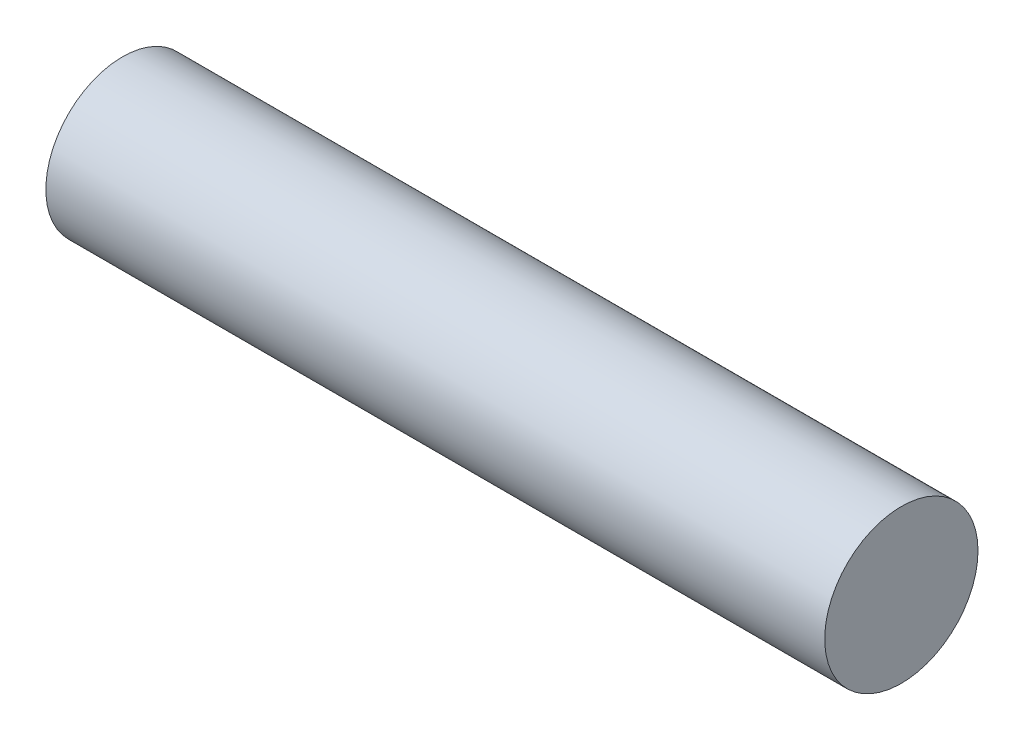
ISO-10303-21;
HEADER;
FILE_DESCRIPTION(('STEP AP214'),'2;1');
FILE_NAME('part.step','',(''),(''),'','','');
FILE_SCHEMA(('AUTOMOTIVE_DESIGN { 1 0 10303 214 1 1 1 1 }'));
ENDSEC;
DATA;
#1=APPLICATION_CONTEXT('core data for automotive mechanical design processes');
#2=APPLICATION_PROTOCOL_DEFINITION('international standard','automotive_design',2000,#1);
#3=PRODUCT_CONTEXT('',#1,'mechanical');
#4=PRODUCT('Part','Part','',(#3));
#5=PRODUCT_RELATED_PRODUCT_CATEGORY('part','',(#4));
#6=PRODUCT_DEFINITION_FORMATION('','',#4);
#7=PRODUCT_DEFINITION_CONTEXT('part definition',#1,'design');
#8=PRODUCT_DEFINITION('design','',#6,#7);
#9=PRODUCT_DEFINITION_SHAPE('','',#8);
#10=(LENGTH_UNIT() NAMED_UNIT(*) SI_UNIT(.MILLI.,.METRE.));
#11=(NAMED_UNIT(*) PLANE_ANGLE_UNIT() SI_UNIT($,.RADIAN.));
#12=(NAMED_UNIT(*) SI_UNIT($,.STERADIAN.) SOLID_ANGLE_UNIT());
#13=UNCERTAINTY_MEASURE_WITH_UNIT(LENGTH_MEASURE(1.E-05),#10,'distance_accuracy_value','');
#14=(GEOMETRIC_REPRESENTATION_CONTEXT(3) GLOBAL_UNCERTAINTY_ASSIGNED_CONTEXT((#13)) GLOBAL_UNIT_ASSIGNED_CONTEXT((#10,
#11,#12)) REPRESENTATION_CONTEXT('',''));
#15=CARTESIAN_POINT('',(0.,0.,0.));
#16=DIRECTION('',(0.,0.,1.));
#17=DIRECTION('',(1.,0.,0.));
#18=AXIS2_PLACEMENT_3D('',#15,#16,#17);
#19=CARTESIAN_POINT('',(25.4,0.,0.));
#20=DIRECTION('',(-1.,0.,0.));
#21=DIRECTION('',(0.,0.,1.));
#22=AXIS2_PLACEMENT_3D('',#19,#20,#21);
#23=CYLINDRICAL_SURFACE('',#22,5.);
#24=CARTESIAN_POINT('',(25.4,0.,0.));
#25=DIRECTION('',(1.,0.,0.));
#26=DIRECTION('',(0.,0.,-1.));
#27=AXIS2_PLACEMENT_3D('',#24,#25,#26);
#28=CIRCLE('',#27,5.);
#29=CARTESIAN_POINT('',(25.4,0.,-5.));
#30=VERTEX_POINT('',#29);
#31=EDGE_CURVE('E10',#30,#30,#28,.T.);
#32=ORIENTED_EDGE('',*,*,#31,.F.);
#33=EDGE_LOOP('',(#32));
#34=FACE_BOUND('',#33,.T.);
#35=CARTESIAN_POINT('',(-25.4,0.,0.));
#36=DIRECTION('',(1.,0.,0.));
#37=DIRECTION('',(0.,0.,-1.));
#38=AXIS2_PLACEMENT_3D('',#35,#36,#37);
#39=CIRCLE('',#38,5.);
#40=CARTESIAN_POINT('',(-25.4,0.,-5.));
#41=VERTEX_POINT('',#40);
#42=EDGE_CURVE('E40',#41,#41,#39,.T.);
#43=ORIENTED_EDGE('',*,*,#42,.T.);
#44=EDGE_LOOP('',(#43));
#45=FACE_BOUND('',#44,.T.);
#46=ADVANCED_FACE('F37',(#34,#45),#23,.T.);
#47=CARTESIAN_POINT('',(25.4,0.,0.));
#48=DIRECTION('',(1.,0.,0.));
#49=DIRECTION('',(0.,0.,-1.));
#50=AXIS2_PLACEMENT_3D('',#47,#48,#49);
#51=PLANE('',#50);
#52=ORIENTED_EDGE('',*,*,#31,.T.);
#53=EDGE_LOOP('',(#52));
#54=FACE_BOUND('',#53,.T.);
#55=ADVANCED_FACE('F54',(#54),#51,.T.);
#56=CARTESIAN_POINT('',(-25.4,0.,0.));
#57=DIRECTION('',(1.,0.,0.));
#58=DIRECTION('',(0.,0.,-1.));
#59=AXIS2_PLACEMENT_3D('',#56,#57,#58);
#60=PLANE('',#59);
#61=ORIENTED_EDGE('',*,*,#42,.F.);
#62=EDGE_LOOP('',(#61));
#63=FACE_BOUND('',#62,.T.);
#64=ADVANCED_FACE('F52',(#63),#60,.F.);
#65=CLOSED_SHELL('',(#46,#55,#64));
#66=MANIFOLD_SOLID_BREP('B2',#65);
#67=ADVANCED_BREP_SHAPE_REPRESENTATION('',(#18,#66),#14);
#68=SHAPE_DEFINITION_REPRESENTATION(#9,#67);
ENDSEC;
END-ISO-10303-21;
